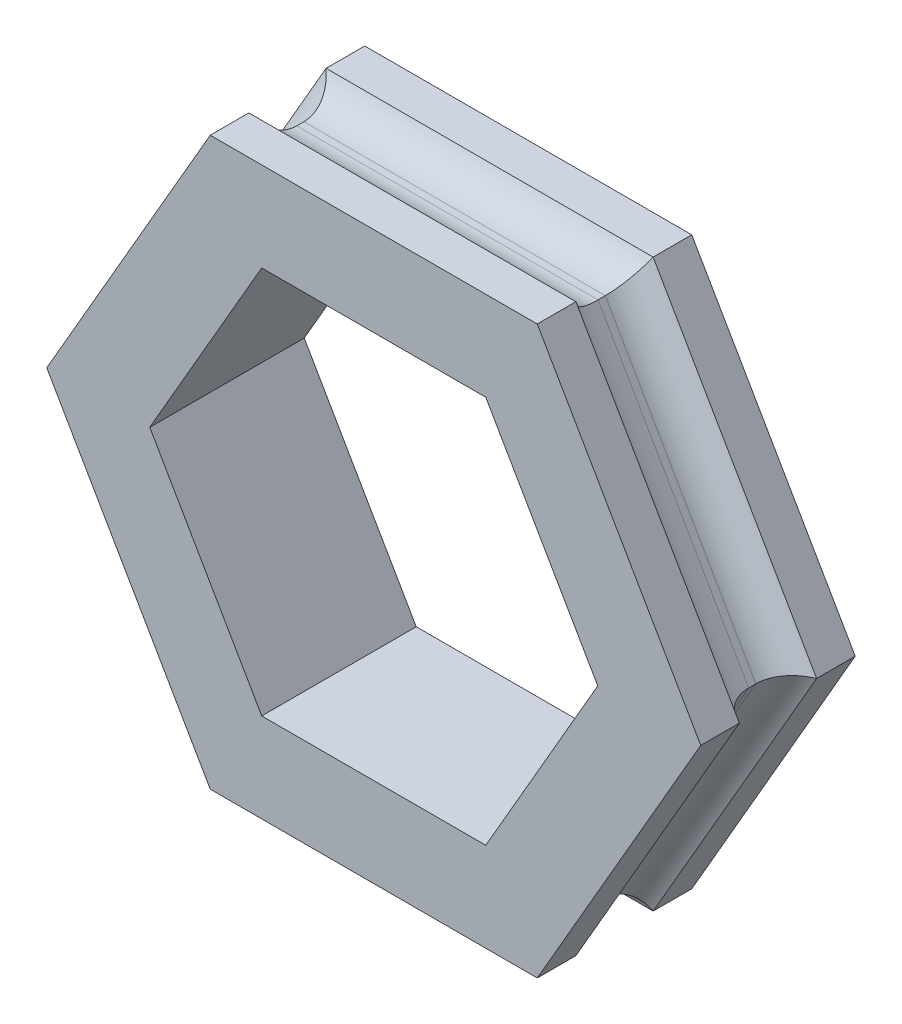
ISO-10303-21;
HEADER;
FILE_DESCRIPTION(('STEP AP214'),'2;1');
FILE_NAME('part.step','',(''),(''),'','','');
FILE_SCHEMA(('AUTOMOTIVE_DESIGN { 1 0 10303 214 1 1 1 1 }'));
ENDSEC;
DATA;
#1=APPLICATION_CONTEXT('core data for automotive mechanical design processes');
#2=APPLICATION_PROTOCOL_DEFINITION('international standard','automotive_design',2000,#1);
#3=PRODUCT_CONTEXT('',#1,'mechanical');
#4=PRODUCT('Part','Part','',(#3));
#5=PRODUCT_RELATED_PRODUCT_CATEGORY('part','',(#4));
#6=PRODUCT_DEFINITION_FORMATION('','',#4);
#7=PRODUCT_DEFINITION_CONTEXT('part definition',#1,'design');
#8=PRODUCT_DEFINITION('design','',#6,#7);
#9=PRODUCT_DEFINITION_SHAPE('','',#8);
#10=(LENGTH_UNIT() NAMED_UNIT(*) SI_UNIT(.MILLI.,.METRE.));
#11=(NAMED_UNIT(*) PLANE_ANGLE_UNIT() SI_UNIT($,.RADIAN.));
#12=(NAMED_UNIT(*) SI_UNIT($,.STERADIAN.) SOLID_ANGLE_UNIT());
#13=UNCERTAINTY_MEASURE_WITH_UNIT(LENGTH_MEASURE(1.E-05),#10,'distance_accuracy_value','');
#14=(GEOMETRIC_REPRESENTATION_CONTEXT(3) GLOBAL_UNCERTAINTY_ASSIGNED_CONTEXT((#13)) GLOBAL_UNIT_ASSIGNED_CONTEXT((#10,
#11,#12)) REPRESENTATION_CONTEXT('',''));
#15=CARTESIAN_POINT('',(0.,0.,0.));
#16=DIRECTION('',(0.,0.,1.));
#17=DIRECTION('',(1.,0.,0.));
#18=AXIS2_PLACEMENT_3D('',#15,#16,#17);
#19=CARTESIAN_POINT('',(0.,-5.49926131403118,-1.5));
#20=DIRECTION('',(0.,-1.,0.));
#21=DIRECTION('',(1.,0.,0.));
#22=AXIS2_PLACEMENT_3D('',#19,#20,#21);
#23=PLANE('',#22);
#24=DIRECTION('',(0.,0.,1.));
#25=VECTOR('',#24,1.);
#26=CARTESIAN_POINT('',(3.175,-5.49926131403119,-1.5));
#27=LINE('',#26,#25);
#28=CARTESIAN_POINT('',(3.175,-5.49926131403119,-1.5));
#29=VERTEX_POINT('',#28);
#30=CARTESIAN_POINT('',(3.175,-5.49926131403119,-0.75));
#31=VERTEX_POINT('',#30);
#32=EDGE_CURVE('E370',#29,#31,#27,.T.);
#33=ORIENTED_EDGE('',*,*,#32,.T.);
#34=DIRECTION('',(1.,0.,0.));
#35=VECTOR('',#34,1.);
#36=CARTESIAN_POINT('',(0.,-5.49926131403118,-0.75));
#37=LINE('',#36,#35);
#38=CARTESIAN_POINT('',(-3.175,-5.49926131403118,-0.75));
#39=VERTEX_POINT('',#38);
#40=EDGE_CURVE('E237',#39,#31,#37,.T.);
#41=ORIENTED_EDGE('',*,*,#40,.F.);
#42=DIRECTION('',(0.,0.,1.));
#43=VECTOR('',#42,1.);
#44=CARTESIAN_POINT('',(-3.175,-5.49926131403118,-1.5));
#45=LINE('',#44,#43);
#46=CARTESIAN_POINT('',(-3.175,-5.49926131403118,-1.5));
#47=VERTEX_POINT('',#46);
#48=EDGE_CURVE('E357',#47,#39,#45,.T.);
#49=ORIENTED_EDGE('',*,*,#48,.F.);
#50=DIRECTION('',(1.,0.,0.));
#51=VECTOR('',#50,1.);
#52=CARTESIAN_POINT('',(0.,-5.49926131403118,-1.5));
#53=LINE('',#52,#51);
#54=EDGE_CURVE('E315',#47,#29,#53,.T.);
#55=ORIENTED_EDGE('',*,*,#54,.T.);
#56=EDGE_LOOP('',(#33,#41,#49,#55));
#57=FACE_BOUND('',#56,.T.);
#58=ADVANCED_FACE('F35',(#57),#23,.T.);
#59=CARTESIAN_POINT('',(-4.7625,-2.74963065701559,-1.5));
#60=DIRECTION('',(-0.866025403784438,-0.5,0.));
#61=DIRECTION('',(0.5,-0.866025403784439,0.));
#62=AXIS2_PLACEMENT_3D('',#59,#60,#61);
#63=PLANE('',#62);
#64=ORIENTED_EDGE('',*,*,#48,.T.);
#65=DIRECTION('',(0.5,-0.866025403784439,0.));
#66=VECTOR('',#65,1.);
#67=CARTESIAN_POINT('',(-4.7625,-2.74963065701559,-0.75));
#68=LINE('',#67,#66);
#69=CARTESIAN_POINT('',(-6.35,0.,-0.75));
#70=VERTEX_POINT('',#69);
#71=EDGE_CURVE('E247',#70,#39,#68,.T.);
#72=ORIENTED_EDGE('',*,*,#71,.F.);
#73=DIRECTION('',(0.,0.,1.));
#74=VECTOR('',#73,1.);
#75=CARTESIAN_POINT('',(-6.35,0.,-1.5));
#76=LINE('',#75,#74);
#77=CARTESIAN_POINT('',(-6.35,0.,-1.5));
#78=VERTEX_POINT('',#77);
#79=EDGE_CURVE('E361',#78,#70,#76,.T.);
#80=ORIENTED_EDGE('',*,*,#79,.F.);
#81=DIRECTION('',(0.5,-0.866025403784439,0.));
#82=VECTOR('',#81,1.);
#83=CARTESIAN_POINT('',(-4.7625,-2.74963065701559,-1.5));
#84=LINE('',#83,#82);
#85=EDGE_CURVE('E327',#78,#47,#84,.T.);
#86=ORIENTED_EDGE('',*,*,#85,.T.);
#87=EDGE_LOOP('',(#64,#72,#80,#86));
#88=FACE_BOUND('',#87,.T.);
#89=ADVANCED_FACE('F433',(#88),#63,.T.);
#90=CARTESIAN_POINT('',(-4.7625,2.74963065701559,-1.5));
#91=DIRECTION('',(-0.866025403784439,0.5,0.));
#92=DIRECTION('',(-0.5,-0.866025403784439,0.));
#93=AXIS2_PLACEMENT_3D('',#90,#91,#92);
#94=PLANE('',#93);
#95=ORIENTED_EDGE('',*,*,#79,.T.);
#96=DIRECTION('',(-0.5,-0.866025403784439,0.));
#97=VECTOR('',#96,1.);
#98=CARTESIAN_POINT('',(-4.7625,2.74963065701559,-0.75));
#99=LINE('',#98,#97);
#100=CARTESIAN_POINT('',(-3.175,5.49926131403119,-0.75));
#101=VERTEX_POINT('',#100);
#102=EDGE_CURVE('E244',#101,#70,#99,.T.);
#103=ORIENTED_EDGE('',*,*,#102,.F.);
#104=DIRECTION('',(0.,0.,1.));
#105=VECTOR('',#104,1.);
#106=CARTESIAN_POINT('',(-3.175,5.49926131403119,-1.5));
#107=LINE('',#106,#105);
#108=CARTESIAN_POINT('',(-3.175,5.49926131403119,-1.5));
#109=VERTEX_POINT('',#108);
#110=EDGE_CURVE('E365',#109,#101,#107,.T.);
#111=ORIENTED_EDGE('',*,*,#110,.F.);
#112=DIRECTION('',(-0.5,-0.866025403784439,0.));
#113=VECTOR('',#112,1.);
#114=CARTESIAN_POINT('',(-4.7625,2.74963065701559,-1.5));
#115=LINE('',#114,#113);
#116=EDGE_CURVE('E324',#109,#78,#115,.T.);
#117=ORIENTED_EDGE('',*,*,#116,.T.);
#118=EDGE_LOOP('',(#95,#103,#111,#117));
#119=FACE_BOUND('',#118,.T.);
#120=ADVANCED_FACE('F426',(#119),#94,.T.);
#121=CARTESIAN_POINT('',(0.,5.49926131403119,-1.5));
#122=DIRECTION('',(0.,1.,0.));
#123=DIRECTION('',(0.,0.,1.));
#124=AXIS2_PLACEMENT_3D('',#121,#122,#123);
#125=PLANE('',#124);
#126=ORIENTED_EDGE('',*,*,#110,.T.);
#127=DIRECTION('',(-1.,0.,0.));
#128=VECTOR('',#127,1.);
#129=CARTESIAN_POINT('',(0.,5.49926131403119,-0.75));
#130=LINE('',#129,#128);
#131=CARTESIAN_POINT('',(3.175,5.49926131403119,-0.75));
#132=VERTEX_POINT('',#131);
#133=EDGE_CURVE('E212',#132,#101,#130,.T.);
#134=ORIENTED_EDGE('',*,*,#133,.F.);
#135=DIRECTION('',(0.,0.,1.));
#136=VECTOR('',#135,1.);
#137=CARTESIAN_POINT('',(3.175,5.49926131403119,-1.5));
#138=LINE('',#137,#136);
#139=CARTESIAN_POINT('',(3.175,5.49926131403119,-1.5));
#140=VERTEX_POINT('',#139);
#141=EDGE_CURVE('E207',#140,#132,#138,.T.);
#142=ORIENTED_EDGE('',*,*,#141,.F.);
#143=DIRECTION('',(-1.,0.,0.));
#144=VECTOR('',#143,1.);
#145=CARTESIAN_POINT('',(0.,5.49926131403119,-1.5));
#146=LINE('',#145,#144);
#147=EDGE_CURVE('E321',#140,#109,#146,.T.);
#148=ORIENTED_EDGE('',*,*,#147,.T.);
#149=EDGE_LOOP('',(#126,#134,#142,#148));
#150=FACE_BOUND('',#149,.T.);
#151=ADVANCED_FACE('F422',(#150),#125,.T.);
#152=CARTESIAN_POINT('',(4.7625,2.74963065701559,-1.5));
#153=DIRECTION('',(0.866025403784438,0.5,0.));
#154=DIRECTION('',(-0.5,0.866025403784439,0.));
#155=AXIS2_PLACEMENT_3D('',#152,#153,#154);
#156=PLANE('',#155);
#157=ORIENTED_EDGE('',*,*,#141,.T.);
#158=DIRECTION('',(-0.5,0.866025403784439,0.));
#159=VECTOR('',#158,1.);
#160=CARTESIAN_POINT('',(4.7625,2.74963065701559,-0.75));
#161=LINE('',#160,#159);
#162=CARTESIAN_POINT('',(6.35,0.,-0.75));
#163=VERTEX_POINT('',#162);
#164=EDGE_CURVE('E201',#163,#132,#161,.T.);
#165=ORIENTED_EDGE('',*,*,#164,.F.);
#166=DIRECTION('',(0.,0.,1.));
#167=VECTOR('',#166,1.);
#168=CARTESIAN_POINT('',(6.35,0.,-1.5));
#169=LINE('',#168,#167);
#170=CARTESIAN_POINT('',(6.35,0.,-1.5));
#171=VERTEX_POINT('',#170);
#172=EDGE_CURVE('E205',#171,#163,#169,.T.);
#173=ORIENTED_EDGE('',*,*,#172,.F.);
#174=DIRECTION('',(-0.5,0.866025403784439,0.));
#175=VECTOR('',#174,1.);
#176=CARTESIAN_POINT('',(4.7625,2.74963065701559,-1.5));
#177=LINE('',#176,#175);
#178=EDGE_CURVE('E319',#171,#140,#177,.T.);
#179=ORIENTED_EDGE('',*,*,#178,.T.);
#180=EDGE_LOOP('',(#157,#165,#173,#179));
#181=FACE_BOUND('',#180,.T.);
#182=ADVANCED_FACE('F203',(#181),#156,.T.);
#183=CARTESIAN_POINT('',(4.7625,-2.74963065701559,-1.5));
#184=DIRECTION('',(0.866025403784439,-0.5,0.));
#185=DIRECTION('',(0.5,0.866025403784439,0.));
#186=AXIS2_PLACEMENT_3D('',#183,#184,#185);
#187=PLANE('',#186);
#188=ORIENTED_EDGE('',*,*,#172,.T.);
#189=DIRECTION('',(0.5,0.866025403784439,0.));
#190=VECTOR('',#189,1.);
#191=CARTESIAN_POINT('',(4.7625,-2.74963065701559,-0.75));
#192=LINE('',#191,#190);
#193=EDGE_CURVE('E213',#31,#163,#192,.T.);
#194=ORIENTED_EDGE('',*,*,#193,.F.);
#195=ORIENTED_EDGE('',*,*,#32,.F.);
#196=DIRECTION('',(0.5,0.866025403784439,0.));
#197=VECTOR('',#196,1.);
#198=CARTESIAN_POINT('',(4.7625,-2.74963065701559,-1.5));
#199=LINE('',#198,#197);
#200=EDGE_CURVE('E221',#29,#171,#199,.T.);
#201=ORIENTED_EDGE('',*,*,#200,.T.);
#202=EDGE_LOOP('',(#188,#194,#195,#201));
#203=FACE_BOUND('',#202,.T.);
#204=ADVANCED_FACE('F217',(#203),#187,.T.);
#205=CARTESIAN_POINT('',(3.2625,-1.88360525323115,-1.5));
#206=DIRECTION('',(0.866025403784439,-0.5,0.));
#207=DIRECTION('',(0.5,0.866025403784439,0.));
#208=AXIS2_PLACEMENT_3D('',#205,#206,#207);
#209=PLANE('',#208);
#210=DIRECTION('',(0.,0.,1.));
#211=VECTOR('',#210,1.);
#212=CARTESIAN_POINT('',(2.175,-3.76721050646231,-1.5));
#213=LINE('',#212,#211);
#214=CARTESIAN_POINT('',(2.175,-3.76721050646231,-1.5));
#215=VERTEX_POINT('',#214);
#216=CARTESIAN_POINT('',(2.175,-3.76721050646231,1.5));
#217=VERTEX_POINT('',#216);
#218=EDGE_CURVE('E355',#215,#217,#213,.T.);
#219=ORIENTED_EDGE('',*,*,#218,.T.);
#220=DIRECTION('',(0.5,0.866025403784439,0.));
#221=VECTOR('',#220,1.);
#222=CARTESIAN_POINT('',(3.2625,-1.88360525323115,1.5));
#223=LINE('',#222,#221);
#224=CARTESIAN_POINT('',(4.35,0.,1.5));
#225=VERTEX_POINT('',#224);
#226=EDGE_CURVE('E297',#217,#225,#223,.T.);
#227=ORIENTED_EDGE('',*,*,#226,.T.);
#228=DIRECTION('',(0.,0.,1.));
#229=VECTOR('',#228,1.);
#230=CARTESIAN_POINT('',(4.35,0.,-1.5));
#231=LINE('',#230,#229);
#232=CARTESIAN_POINT('',(4.35,0.,-1.5));
#233=VERTEX_POINT('',#232);
#234=EDGE_CURVE('E344',#233,#225,#231,.T.);
#235=ORIENTED_EDGE('',*,*,#234,.F.);
#236=DIRECTION('',(0.5,0.866025403784439,0.));
#237=VECTOR('',#236,1.);
#238=CARTESIAN_POINT('',(3.2625,-1.88360525323115,-1.5));
#239=LINE('',#238,#237);
#240=EDGE_CURVE('E330',#215,#233,#239,.T.);
#241=ORIENTED_EDGE('',*,*,#240,.F.);
#242=EDGE_LOOP('',(#219,#227,#235,#241));
#243=FACE_BOUND('',#242,.T.);
#244=ADVANCED_FACE('F557',(#243),#209,.F.);
#245=CARTESIAN_POINT('',(3.2625,1.88360525323115,-1.5));
#246=DIRECTION('',(0.866025403784439,0.5,0.));
#247=DIRECTION('',(-0.5,0.866025403784439,0.));
#248=AXIS2_PLACEMENT_3D('',#245,#246,#247);
#249=PLANE('',#248);
#250=ORIENTED_EDGE('',*,*,#234,.T.);
#251=DIRECTION('',(-0.5,0.866025403784439,0.));
#252=VECTOR('',#251,1.);
#253=CARTESIAN_POINT('',(3.2625,1.88360525323115,1.5));
#254=LINE('',#253,#252);
#255=CARTESIAN_POINT('',(2.175,3.76721050646231,1.5));
#256=VERTEX_POINT('',#255);
#257=EDGE_CURVE('E312',#225,#256,#254,.T.);
#258=ORIENTED_EDGE('',*,*,#257,.T.);
#259=DIRECTION('',(0.,0.,1.));
#260=VECTOR('',#259,1.);
#261=CARTESIAN_POINT('',(2.175,3.76721050646231,-1.5));
#262=LINE('',#261,#260);
#263=CARTESIAN_POINT('',(2.175,3.76721050646231,-1.5));
#264=VERTEX_POINT('',#263);
#265=EDGE_CURVE('E347',#264,#256,#262,.T.);
#266=ORIENTED_EDGE('',*,*,#265,.F.);
#267=DIRECTION('',(-0.5,0.866025403784439,0.));
#268=VECTOR('',#267,1.);
#269=CARTESIAN_POINT('',(3.2625,1.88360525323115,-1.5));
#270=LINE('',#269,#268);
#271=EDGE_CURVE('E341',#233,#264,#270,.T.);
#272=ORIENTED_EDGE('',*,*,#271,.F.);
#273=EDGE_LOOP('',(#250,#258,#266,#272));
#274=FACE_BOUND('',#273,.T.);
#275=ADVANCED_FACE('F561',(#274),#249,.F.);
#276=CARTESIAN_POINT('',(0.,3.76721050646231,-1.5));
#277=DIRECTION('',(0.,1.,0.));
#278=DIRECTION('',(0.,0.,1.));
#279=AXIS2_PLACEMENT_3D('',#276,#277,#278);
#280=PLANE('',#279);
#281=ORIENTED_EDGE('',*,*,#265,.T.);
#282=DIRECTION('',(-1.,0.,0.));
#283=VECTOR('',#282,1.);
#284=CARTESIAN_POINT('',(0.,3.76721050646231,1.5));
#285=LINE('',#284,#283);
#286=CARTESIAN_POINT('',(-2.175,3.76721050646231,1.5));
#287=VERTEX_POINT('',#286);
#288=EDGE_CURVE('E309',#256,#287,#285,.T.);
#289=ORIENTED_EDGE('',*,*,#288,.T.);
#290=DIRECTION('',(0.,0.,1.));
#291=VECTOR('',#290,1.);
#292=CARTESIAN_POINT('',(-2.175,3.76721050646231,-1.5));
#293=LINE('',#292,#291);
#294=CARTESIAN_POINT('',(-2.175,3.76721050646231,-1.5));
#295=VERTEX_POINT('',#294);
#296=EDGE_CURVE('E349',#295,#287,#293,.T.);
#297=ORIENTED_EDGE('',*,*,#296,.F.);
#298=DIRECTION('',(-1.,0.,0.));
#299=VECTOR('',#298,1.);
#300=CARTESIAN_POINT('',(0.,3.76721050646231,-1.5));
#301=LINE('',#300,#299);
#302=EDGE_CURVE('E339',#264,#295,#301,.T.);
#303=ORIENTED_EDGE('',*,*,#302,.F.);
#304=EDGE_LOOP('',(#281,#289,#297,#303));
#305=FACE_BOUND('',#304,.T.);
#306=ADVANCED_FACE('F567',(#305),#280,.F.);
#307=CARTESIAN_POINT('',(-3.2625,1.88360525323115,-1.5));
#308=DIRECTION('',(-0.866025403784439,0.5,0.));
#309=DIRECTION('',(-0.5,-0.866025403784439,0.));
#310=AXIS2_PLACEMENT_3D('',#307,#308,#309);
#311=PLANE('',#310);
#312=ORIENTED_EDGE('',*,*,#296,.T.);
#313=DIRECTION('',(-0.5,-0.866025403784439,0.));
#314=VECTOR('',#313,1.);
#315=CARTESIAN_POINT('',(-3.2625,1.88360525323115,1.5));
#316=LINE('',#315,#314);
#317=CARTESIAN_POINT('',(-4.35,0.,1.5));
#318=VERTEX_POINT('',#317);
#319=EDGE_CURVE('E306',#287,#318,#316,.T.);
#320=ORIENTED_EDGE('',*,*,#319,.T.);
#321=DIRECTION('',(0.,0.,1.));
#322=VECTOR('',#321,1.);
#323=CARTESIAN_POINT('',(-4.35,0.,-1.5));
#324=LINE('',#323,#322);
#325=CARTESIAN_POINT('',(-4.35,0.,-1.5));
#326=VERTEX_POINT('',#325);
#327=EDGE_CURVE('E351',#326,#318,#324,.T.);
#328=ORIENTED_EDGE('',*,*,#327,.F.);
#329=DIRECTION('',(-0.5,-0.866025403784439,0.));
#330=VECTOR('',#329,1.);
#331=CARTESIAN_POINT('',(-3.2625,1.88360525323115,-1.5));
#332=LINE('',#331,#330);
#333=EDGE_CURVE('E337',#295,#326,#332,.T.);
#334=ORIENTED_EDGE('',*,*,#333,.F.);
#335=EDGE_LOOP('',(#312,#320,#328,#334));
#336=FACE_BOUND('',#335,.T.);
#337=ADVANCED_FACE('F475',(#336),#311,.F.);
#338=CARTESIAN_POINT('',(-3.2625,-1.88360525323115,-1.5));
#339=DIRECTION('',(-0.866025403784438,-0.5,0.));
#340=DIRECTION('',(0.5,-0.866025403784439,0.));
#341=AXIS2_PLACEMENT_3D('',#338,#339,#340);
#342=PLANE('',#341);
#343=ORIENTED_EDGE('',*,*,#327,.T.);
#344=DIRECTION('',(0.5,-0.866025403784439,0.));
#345=VECTOR('',#344,1.);
#346=CARTESIAN_POINT('',(-3.2625,-1.88360525323115,1.5));
#347=LINE('',#346,#345);
#348=CARTESIAN_POINT('',(-2.175,-3.76721050646231,1.5));
#349=VERTEX_POINT('',#348);
#350=EDGE_CURVE('E303',#318,#349,#347,.T.);
#351=ORIENTED_EDGE('',*,*,#350,.T.);
#352=DIRECTION('',(0.,0.,1.));
#353=VECTOR('',#352,1.);
#354=CARTESIAN_POINT('',(-2.175,-3.76721050646231,-1.5));
#355=LINE('',#354,#353);
#356=CARTESIAN_POINT('',(-2.175,-3.76721050646231,-1.5));
#357=VERTEX_POINT('',#356);
#358=EDGE_CURVE('E353',#357,#349,#355,.T.);
#359=ORIENTED_EDGE('',*,*,#358,.F.);
#360=DIRECTION('',(0.5,-0.866025403784439,0.));
#361=VECTOR('',#360,1.);
#362=CARTESIAN_POINT('',(-3.2625,-1.88360525323115,-1.5));
#363=LINE('',#362,#361);
#364=EDGE_CURVE('E335',#326,#357,#363,.T.);
#365=ORIENTED_EDGE('',*,*,#364,.F.);
#366=EDGE_LOOP('',(#343,#351,#359,#365));
#367=FACE_BOUND('',#366,.T.);
#368=ADVANCED_FACE('F467',(#367),#342,.F.);
#369=DIRECTION('',(1.,0.,0.));
#370=VECTOR('',#369,1.);
#371=CARTESIAN_POINT('',(0.,-5.49926131403118,0.75));
#372=LINE('',#371,#370);
#373=CARTESIAN_POINT('',(-3.175,-5.49926131403118,0.75));
#374=VERTEX_POINT('',#373);
#375=CARTESIAN_POINT('',(3.175,-5.49926131403119,0.75));
#376=VERTEX_POINT('',#375);
#377=EDGE_CURVE('E249',#374,#376,#372,.T.);
#378=ORIENTED_EDGE('',*,*,#377,.T.);
#379=CARTESIAN_POINT('',(3.175,-5.49926131403119,1.5));
#380=VERTEX_POINT('',#379);
#381=EDGE_CURVE('E343',#376,#380,#27,.T.);
#382=ORIENTED_EDGE('',*,*,#381,.T.);
#383=DIRECTION('',(1.,0.,0.));
#384=VECTOR('',#383,1.);
#385=CARTESIAN_POINT('',(0.,-5.49926131403118,1.5));
#386=LINE('',#385,#384);
#387=CARTESIAN_POINT('',(-3.175,-5.49926131403118,1.5));
#388=VERTEX_POINT('',#387);
#389=EDGE_CURVE('E279',#388,#380,#386,.T.);
#390=ORIENTED_EDGE('',*,*,#389,.F.);
#391=EDGE_CURVE('E360',#374,#388,#45,.T.);
#392=ORIENTED_EDGE('',*,*,#391,.F.);
#393=EDGE_LOOP('',(#378,#382,#390,#392));
#394=FACE_BOUND('',#393,.T.);
#395=ADVANCED_FACE('F458',(#394),#23,.T.);
#396=DIRECTION('',(0.5,-0.866025403784439,0.));
#397=VECTOR('',#396,1.);
#398=CARTESIAN_POINT('',(-4.7625,-2.74963065701559,0.75));
#399=LINE('',#398,#397);
#400=CARTESIAN_POINT('',(-6.35,0.,0.75));
#401=VERTEX_POINT('',#400);
#402=EDGE_CURVE('E260',#401,#374,#399,.T.);
#403=ORIENTED_EDGE('',*,*,#402,.T.);
#404=ORIENTED_EDGE('',*,*,#391,.T.);
#405=DIRECTION('',(0.5,-0.866025403784439,0.));
#406=VECTOR('',#405,1.);
#407=CARTESIAN_POINT('',(-4.7625,-2.74963065701559,1.5));
#408=LINE('',#407,#406);
#409=CARTESIAN_POINT('',(-6.35,0.,1.5));
#410=VERTEX_POINT('',#409);
#411=EDGE_CURVE('E294',#410,#388,#408,.T.);
#412=ORIENTED_EDGE('',*,*,#411,.F.);
#413=EDGE_CURVE('E364',#401,#410,#76,.T.);
#414=ORIENTED_EDGE('',*,*,#413,.F.);
#415=EDGE_LOOP('',(#403,#404,#412,#414));
#416=FACE_BOUND('',#415,.T.);
#417=ADVANCED_FACE('F463',(#416),#63,.T.);
#418=DIRECTION('',(-0.5,-0.866025403784439,0.));
#419=VECTOR('',#418,1.);
#420=CARTESIAN_POINT('',(-4.7625,2.74963065701559,0.75));
#421=LINE('',#420,#419);
#422=CARTESIAN_POINT('',(-3.175,5.49926131403119,0.75));
#423=VERTEX_POINT('',#422);
#424=EDGE_CURVE('E257',#423,#401,#421,.T.);
#425=ORIENTED_EDGE('',*,*,#424,.T.);
#426=ORIENTED_EDGE('',*,*,#413,.T.);
#427=DIRECTION('',(-0.5,-0.866025403784439,0.));
#428=VECTOR('',#427,1.);
#429=CARTESIAN_POINT('',(-4.7625,2.74963065701559,1.5));
#430=LINE('',#429,#428);
#431=CARTESIAN_POINT('',(-3.175,5.49926131403119,1.5));
#432=VERTEX_POINT('',#431);
#433=EDGE_CURVE('E291',#432,#410,#430,.T.);
#434=ORIENTED_EDGE('',*,*,#433,.F.);
#435=EDGE_CURVE('E368',#423,#432,#107,.T.);
#436=ORIENTED_EDGE('',*,*,#435,.F.);
#437=EDGE_LOOP('',(#425,#426,#434,#436));
#438=FACE_BOUND('',#437,.T.);
#439=ADVANCED_FACE('F473',(#438),#94,.T.);
#440=DIRECTION('',(-1.,0.,0.));
#441=VECTOR('',#440,1.);
#442=CARTESIAN_POINT('',(0.,5.49926131403119,0.75));
#443=LINE('',#442,#441);
#444=CARTESIAN_POINT('',(3.175,5.49926131403119,0.75));
#445=VERTEX_POINT('',#444);
#446=EDGE_CURVE('E255',#445,#423,#443,.T.);
#447=ORIENTED_EDGE('',*,*,#446,.T.);
#448=ORIENTED_EDGE('',*,*,#435,.T.);
#449=DIRECTION('',(-1.,0.,0.));
#450=VECTOR('',#449,1.);
#451=CARTESIAN_POINT('',(0.,5.49926131403119,1.5));
#452=LINE('',#451,#450);
#453=CARTESIAN_POINT('',(3.175,5.49926131403119,1.5));
#454=VERTEX_POINT('',#453);
#455=EDGE_CURVE('E288',#454,#432,#452,.T.);
#456=ORIENTED_EDGE('',*,*,#455,.F.);
#457=EDGE_CURVE('E222',#445,#454,#138,.T.);
#458=ORIENTED_EDGE('',*,*,#457,.F.);
#459=EDGE_LOOP('',(#447,#448,#456,#458));
#460=FACE_BOUND('',#459,.T.);
#461=ADVANCED_FACE('F526',(#460),#125,.T.);
#462=DIRECTION('',(-0.5,0.866025403784439,0.));
#463=VECTOR('',#462,1.);
#464=CARTESIAN_POINT('',(4.7625,2.74963065701559,0.75));
#465=LINE('',#464,#463);
#466=CARTESIAN_POINT('',(6.35,0.,0.75));
#467=VERTEX_POINT('',#466);
#468=EDGE_CURVE('E253',#467,#445,#465,.T.);
#469=ORIENTED_EDGE('',*,*,#468,.T.);
#470=ORIENTED_EDGE('',*,*,#457,.T.);
#471=DIRECTION('',(-0.5,0.866025403784439,0.));
#472=VECTOR('',#471,1.);
#473=CARTESIAN_POINT('',(4.7625,2.74963065701559,1.5));
#474=LINE('',#473,#472);
#475=CARTESIAN_POINT('',(6.35,0.,1.5));
#476=VERTEX_POINT('',#475);
#477=EDGE_CURVE('E285',#476,#454,#474,.T.);
#478=ORIENTED_EDGE('',*,*,#477,.F.);
#479=EDGE_CURVE('E223',#467,#476,#169,.T.);
#480=ORIENTED_EDGE('',*,*,#479,.F.);
#481=EDGE_LOOP('',(#469,#470,#478,#480));
#482=FACE_BOUND('',#481,.T.);
#483=ADVANCED_FACE('F522',(#482),#156,.T.);
#484=DIRECTION('',(0.5,0.866025403784439,0.));
#485=VECTOR('',#484,1.);
#486=CARTESIAN_POINT('',(4.7625,-2.74963065701559,0.75));
#487=LINE('',#486,#485);
#488=EDGE_CURVE('E251',#376,#467,#487,.T.);
#489=ORIENTED_EDGE('',*,*,#488,.T.);
#490=ORIENTED_EDGE('',*,*,#479,.T.);
#491=DIRECTION('',(0.5,0.866025403784439,0.));
#492=VECTOR('',#491,1.);
#493=CARTESIAN_POINT('',(4.7625,-2.74963065701559,1.5));
#494=LINE('',#493,#492);
#495=EDGE_CURVE('E282',#380,#476,#494,.T.);
#496=ORIENTED_EDGE('',*,*,#495,.F.);
#497=ORIENTED_EDGE('',*,*,#381,.F.);
#498=EDGE_LOOP('',(#489,#490,#496,#497));
#499=FACE_BOUND('',#498,.T.);
#500=ADVANCED_FACE('F486',(#499),#187,.T.);
#501=CARTESIAN_POINT('',(0.,-3.76721050646231,-1.5));
#502=DIRECTION('',(0.,-1.,0.));
#503=DIRECTION('',(1.,0.,0.));
#504=AXIS2_PLACEMENT_3D('',#501,#502,#503);
#505=PLANE('',#504);
#506=ORIENTED_EDGE('',*,*,#358,.T.);
#507=DIRECTION('',(1.,0.,0.));
#508=VECTOR('',#507,1.);
#509=CARTESIAN_POINT('',(0.,-3.76721050646231,1.5));
#510=LINE('',#509,#508);
#511=EDGE_CURVE('E300',#349,#217,#510,.T.);
#512=ORIENTED_EDGE('',*,*,#511,.T.);
#513=ORIENTED_EDGE('',*,*,#218,.F.);
#514=DIRECTION('',(1.,0.,0.));
#515=VECTOR('',#514,1.);
#516=CARTESIAN_POINT('',(0.,-3.76721050646231,-1.5));
#517=LINE('',#516,#515);
#518=EDGE_CURVE('E333',#357,#215,#517,.T.);
#519=ORIENTED_EDGE('',*,*,#518,.F.);
#520=EDGE_LOOP('',(#506,#512,#513,#519));
#521=FACE_BOUND('',#520,.T.);
#522=ADVANCED_FACE('F550',(#521),#505,.F.);
#523=CARTESIAN_POINT('',(0.,0.,-1.5));
#524=DIRECTION('',(0.,0.,1.));
#525=DIRECTION('',(1.,0.,0.));
#526=AXIS2_PLACEMENT_3D('',#523,#524,#525);
#527=PLANE('',#526);
#528=ORIENTED_EDGE('',*,*,#54,.F.);
#529=ORIENTED_EDGE('',*,*,#85,.F.);
#530=ORIENTED_EDGE('',*,*,#116,.F.);
#531=ORIENTED_EDGE('',*,*,#147,.F.);
#532=ORIENTED_EDGE('',*,*,#178,.F.);
#533=ORIENTED_EDGE('',*,*,#200,.F.);
#534=EDGE_LOOP('',(#528,#529,#530,#531,#532,#533));
#535=FACE_BOUND('',#534,.T.);
#536=ORIENTED_EDGE('',*,*,#240,.T.);
#537=ORIENTED_EDGE('',*,*,#271,.T.);
#538=ORIENTED_EDGE('',*,*,#302,.T.);
#539=ORIENTED_EDGE('',*,*,#333,.T.);
#540=ORIENTED_EDGE('',*,*,#364,.T.);
#541=ORIENTED_EDGE('',*,*,#518,.T.);
#542=EDGE_LOOP('',(#536,#537,#538,#539,#540,#541));
#543=FACE_BOUND('',#542,.T.);
#544=ADVANCED_FACE('F430',(#535,#543),#527,.F.);
#545=CARTESIAN_POINT('',(0.,0.,1.5));
#546=DIRECTION('',(0.,0.,1.));
#547=DIRECTION('',(1.,0.,0.));
#548=AXIS2_PLACEMENT_3D('',#545,#546,#547);
#549=PLANE('',#548);
#550=ORIENTED_EDGE('',*,*,#389,.T.);
#551=ORIENTED_EDGE('',*,*,#495,.T.);
#552=ORIENTED_EDGE('',*,*,#477,.T.);
#553=ORIENTED_EDGE('',*,*,#455,.T.);
#554=ORIENTED_EDGE('',*,*,#433,.T.);
#555=ORIENTED_EDGE('',*,*,#411,.T.);
#556=EDGE_LOOP('',(#550,#551,#552,#553,#554,#555));
#557=FACE_BOUND('',#556,.T.);
#558=ORIENTED_EDGE('',*,*,#226,.F.);
#559=ORIENTED_EDGE('',*,*,#511,.F.);
#560=ORIENTED_EDGE('',*,*,#350,.F.);
#561=ORIENTED_EDGE('',*,*,#319,.F.);
#562=ORIENTED_EDGE('',*,*,#288,.F.);
#563=ORIENTED_EDGE('',*,*,#257,.F.);
#564=EDGE_LOOP('',(#558,#559,#560,#561,#562,#563));
#565=FACE_BOUND('',#564,.T.);
#566=ADVANCED_FACE('F452',(#557,#565),#549,.T.);
#567=CARTESIAN_POINT('',(4.3875,-2.53312430606948,0.75));
#568=DIRECTION('',(-0.866025403784439,0.5,0.));
#569=DIRECTION('',(-0.5,-0.866025403784439,0.));
#570=AXIS2_PLACEMENT_3D('',#567,#568,#569);
#571=PLANE('',#570);
#572=DIRECTION('',(0.,0.,-1.));
#573=VECTOR('',#572,1.);
#574=CARTESIAN_POINT('',(5.85,0.,0.75));
#575=LINE('',#574,#573);
#576=CARTESIAN_POINT('',(5.85,0.,0.07028016592251));
#577=VERTEX_POINT('',#576);
#578=CARTESIAN_POINT('',(5.85,0.,-0.07028016592251));
#579=VERTEX_POINT('',#578);
#580=EDGE_CURVE('E262',#577,#579,#575,.T.);
#581=ORIENTED_EDGE('',*,*,#580,.F.);
#582=DIRECTION('',(0.5,0.866025403784439,0.));
#583=VECTOR('',#582,1.);
#584=CARTESIAN_POINT('',(4.3875,-2.53312430606948,0.07028016592251));
#585=LINE('',#584,#583);
#586=CARTESIAN_POINT('',(2.925,-5.06624861213897,0.0702801659225117));
#587=VERTEX_POINT('',#586);
#588=EDGE_CURVE('E385',#577,#587,#585,.F.);
#589=ORIENTED_EDGE('',*,*,#588,.T.);
#590=DIRECTION('',(0.,0.,-1.));
#591=VECTOR('',#590,1.);
#592=CARTESIAN_POINT('',(2.925,-5.06624861213897,0.75));
#593=LINE('',#592,#591);
#594=CARTESIAN_POINT('',(2.925,-5.06624861213897,-0.0702801659225117));
#595=VERTEX_POINT('',#594);
#596=EDGE_CURVE('E276',#587,#595,#593,.T.);
#597=ORIENTED_EDGE('',*,*,#596,.T.);
#598=DIRECTION('',(0.5,0.866025403784439,0.));
#599=VECTOR('',#598,1.);
#600=CARTESIAN_POINT('',(4.3875,-2.53312430606948,-0.07028016592251));
#601=LINE('',#600,#599);
#602=EDGE_CURVE('E383',#595,#579,#601,.T.);
#603=ORIENTED_EDGE('',*,*,#602,.T.);
#604=EDGE_LOOP('',(#581,#589,#597,#603));
#605=FACE_BOUND('',#604,.T.);
#606=ADVANCED_FACE('F444',(#605),#571,.F.);
#607=CARTESIAN_POINT('',(0.,-5.06624861213897,0.75));
#608=DIRECTION('',(0.,1.,0.));
#609=DIRECTION('',(-1.,0.,0.));
#610=AXIS2_PLACEMENT_3D('',#607,#608,#609);
#611=PLANE('',#610);
#612=ORIENTED_EDGE('',*,*,#596,.F.);
#613=DIRECTION('',(1.,0.,0.));
#614=VECTOR('',#613,1.);
#615=CARTESIAN_POINT('',(0.,-5.06624861213897,0.0702801659225117));
#616=LINE('',#615,#614);
#617=CARTESIAN_POINT('',(-2.925,-5.06624861213897,0.0702801659225103));
#618=VERTEX_POINT('',#617);
#619=EDGE_CURVE('E60',#587,#618,#616,.F.);
#620=ORIENTED_EDGE('',*,*,#619,.T.);
#621=DIRECTION('',(0.,0.,-1.));
#622=VECTOR('',#621,1.);
#623=CARTESIAN_POINT('',(-2.925,-5.06624861213897,0.75));
#624=LINE('',#623,#622);
#625=CARTESIAN_POINT('',(-2.925,-5.06624861213897,-0.0702801659225117));
#626=VERTEX_POINT('',#625);
#627=EDGE_CURVE('E274',#618,#626,#624,.T.);
#628=ORIENTED_EDGE('',*,*,#627,.T.);
#629=DIRECTION('',(1.,0.,0.));
#630=VECTOR('',#629,1.);
#631=CARTESIAN_POINT('',(0.,-5.06624861213897,-0.0702801659225117));
#632=LINE('',#631,#630);
#633=EDGE_CURVE('E387',#626,#595,#632,.T.);
#634=ORIENTED_EDGE('',*,*,#633,.T.);
#635=EDGE_LOOP('',(#612,#620,#628,#634));
#636=FACE_BOUND('',#635,.T.);
#637=ADVANCED_FACE('F441',(#636),#611,.F.);
#638=CARTESIAN_POINT('',(-4.3875,-2.53312430606948,0.75));
#639=DIRECTION('',(0.866025403784439,0.5,0.));
#640=DIRECTION('',(-0.5,0.866025403784439,0.));
#641=AXIS2_PLACEMENT_3D('',#638,#639,#640);
#642=PLANE('',#641);
#643=ORIENTED_EDGE('',*,*,#627,.F.);
#644=DIRECTION('',(0.5,-0.866025403784439,0.));
#645=VECTOR('',#644,1.);
#646=CARTESIAN_POINT('',(-4.3875,-2.53312430606948,0.0702801659225103));
#647=LINE('',#646,#645);
#648=CARTESIAN_POINT('',(-5.85,0.,0.0702801659225103));
#649=VERTEX_POINT('',#648);
#650=EDGE_CURVE('E11',#618,#649,#647,.F.);
#651=ORIENTED_EDGE('',*,*,#650,.T.);
#652=DIRECTION('',(0.,0.,-1.));
#653=VECTOR('',#652,1.);
#654=CARTESIAN_POINT('',(-5.85,0.,0.75));
#655=LINE('',#654,#653);
#656=CARTESIAN_POINT('',(-5.85,0.,-0.0702801659225111));
#657=VERTEX_POINT('',#656);
#658=EDGE_CURVE('E271',#649,#657,#655,.T.);
#659=ORIENTED_EDGE('',*,*,#658,.T.);
#660=DIRECTION('',(0.5,-0.866025403784439,0.));
#661=VECTOR('',#660,1.);
#662=CARTESIAN_POINT('',(-4.3875,-2.53312430606948,-0.0702801659225103));
#663=LINE('',#662,#661);
#664=EDGE_CURVE('E44',#657,#626,#663,.T.);
#665=ORIENTED_EDGE('',*,*,#664,.T.);
#666=EDGE_LOOP('',(#643,#651,#659,#665));
#667=FACE_BOUND('',#666,.T.);
#668=ADVANCED_FACE('F438',(#667),#642,.F.);
#669=CARTESIAN_POINT('',(-4.3875,2.53312430606948,0.75));
#670=DIRECTION('',(0.866025403784439,-0.5,0.));
#671=DIRECTION('',(0.5,0.866025403784439,0.));
#672=AXIS2_PLACEMENT_3D('',#669,#670,#671);
#673=PLANE('',#672);
#674=ORIENTED_EDGE('',*,*,#658,.F.);
#675=DIRECTION('',(-0.5,-0.866025403784439,0.));
#676=VECTOR('',#675,1.);
#677=CARTESIAN_POINT('',(-4.3875,2.53312430606948,0.0702801659225111));
#678=LINE('',#677,#676);
#679=CARTESIAN_POINT('',(-2.925,5.06624861213896,0.0702801659225093));
#680=VERTEX_POINT('',#679);
#681=EDGE_CURVE('E373',#649,#680,#678,.F.);
#682=ORIENTED_EDGE('',*,*,#681,.T.);
#683=DIRECTION('',(0.,0.,-1.));
#684=VECTOR('',#683,1.);
#685=CARTESIAN_POINT('',(-2.925,5.06624861213896,0.75));
#686=LINE('',#685,#684);
#687=CARTESIAN_POINT('',(-2.925,5.06624861213896,-0.0702801659225093));
#688=VERTEX_POINT('',#687);
#689=EDGE_CURVE('E268',#680,#688,#686,.T.);
#690=ORIENTED_EDGE('',*,*,#689,.T.);
#691=DIRECTION('',(-0.5,-0.866025403784439,0.));
#692=VECTOR('',#691,1.);
#693=CARTESIAN_POINT('',(-4.3875,2.53312430606948,-0.0702801659225111));
#694=LINE('',#693,#692);
#695=EDGE_CURVE('E346',#688,#657,#694,.T.);
#696=ORIENTED_EDGE('',*,*,#695,.T.);
#697=EDGE_LOOP('',(#674,#682,#690,#696));
#698=FACE_BOUND('',#697,.T.);
#699=ADVANCED_FACE('F450',(#698),#673,.F.);
#700=CARTESIAN_POINT('',(0.,5.06624861213896,0.75));
#701=DIRECTION('',(0.,-1.,0.));
#702=DIRECTION('',(0.,0.,-1.));
#703=AXIS2_PLACEMENT_3D('',#700,#701,#702);
#704=PLANE('',#703);
#705=ORIENTED_EDGE('',*,*,#689,.F.);
#706=DIRECTION('',(-1.,0.,0.));
#707=VECTOR('',#706,1.);
#708=CARTESIAN_POINT('',(0.,5.06624861213896,0.0702801659225093));
#709=LINE('',#708,#707);
#710=CARTESIAN_POINT('',(2.925,5.06624861213896,0.0702801659225099));
#711=VERTEX_POINT('',#710);
#712=EDGE_CURVE('E378',#680,#711,#709,.F.);
#713=ORIENTED_EDGE('',*,*,#712,.T.);
#714=DIRECTION('',(0.,0.,-1.));
#715=VECTOR('',#714,1.);
#716=CARTESIAN_POINT('',(2.925,5.06624861213896,0.75));
#717=LINE('',#716,#715);
#718=CARTESIAN_POINT('',(2.925,5.06624861213896,-0.0702801659225099));
#719=VERTEX_POINT('',#718);
#720=EDGE_CURVE('E265',#711,#719,#717,.T.);
#721=ORIENTED_EDGE('',*,*,#720,.T.);
#722=DIRECTION('',(-1.,0.,0.));
#723=VECTOR('',#722,1.);
#724=CARTESIAN_POINT('',(0.,5.06624861213896,-0.0702801659225093));
#725=LINE('',#724,#723);
#726=EDGE_CURVE('E376',#719,#688,#725,.T.);
#727=ORIENTED_EDGE('',*,*,#726,.T.);
#728=EDGE_LOOP('',(#705,#713,#721,#727));
#729=FACE_BOUND('',#728,.T.);
#730=ADVANCED_FACE('F513',(#729),#704,.F.);
#731=CARTESIAN_POINT('',(4.3875,2.53312430606948,0.75));
#732=DIRECTION('',(-0.866025403784439,-0.5,0.));
#733=DIRECTION('',(0.5,-0.866025403784439,0.));
#734=AXIS2_PLACEMENT_3D('',#731,#732,#733);
#735=PLANE('',#734);
#736=ORIENTED_EDGE('',*,*,#720,.F.);
#737=DIRECTION('',(-0.5,0.866025403784439,0.));
#738=VECTOR('',#737,1.);
#739=CARTESIAN_POINT('',(4.3875,2.53312430606948,0.0702801659225099));
#740=LINE('',#739,#738);
#741=EDGE_CURVE('E381',#711,#577,#740,.F.);
#742=ORIENTED_EDGE('',*,*,#741,.T.);
#743=ORIENTED_EDGE('',*,*,#580,.T.);
#744=DIRECTION('',(-0.5,0.866025403784439,0.));
#745=VECTOR('',#744,1.);
#746=CARTESIAN_POINT('',(4.3875,2.53312430606948,-0.0702801659225099));
#747=LINE('',#746,#745);
#748=EDGE_CURVE('E228',#579,#719,#747,.T.);
#749=ORIENTED_EDGE('',*,*,#748,.T.);
#750=EDGE_LOOP('',(#736,#742,#743,#749));
#751=FACE_BOUND('',#750,.T.);
#752=ADVANCED_FACE('F516',(#751),#735,.F.);
#753=CARTESIAN_POINT('',(5.03701905283833,-2.90812430606948,0.07028016592251));
#754=DIRECTION('',(0.5,0.866025403784439,0.));
#755=DIRECTION('',(-0.866025403784439,0.5,0.));
#756=AXIS2_PLACEMENT_3D('',#753,#754,#755);
#757=CYLINDRICAL_SURFACE('',#756,0.75);
#758=CARTESIAN_POINT('',(3.35801270189222,-5.81624861213897,0.0702801659225109));
#759=DIRECTION('',(0.866025403784438,0.5,0.));
#760=DIRECTION('',(-0.5,0.866025403784439,0.));
#761=AXIS2_PLACEMENT_3D('',#758,#759,#760);
#762=ELLIPSE('',#761,0.866025403784439,0.75);
#763=EDGE_CURVE('E402',#587,#376,#762,.T.);
#764=ORIENTED_EDGE('',*,*,#763,.F.);
#765=ORIENTED_EDGE('',*,*,#588,.F.);
#766=CARTESIAN_POINT('',(6.71602540378444,0.,0.07028016592251));
#767=DIRECTION('',(0.,1.,0.));
#768=DIRECTION('',(1.,0.,0.));
#769=AXIS2_PLACEMENT_3D('',#766,#767,#768);
#770=ELLIPSE('',#769,0.866025403784439,0.75);
#771=EDGE_CURVE('E239',#467,#577,#770,.F.);
#772=ORIENTED_EDGE('',*,*,#771,.F.);
#773=ORIENTED_EDGE('',*,*,#488,.F.);
#774=EDGE_LOOP('',(#764,#765,#772,#773));
#775=FACE_BOUND('',#774,.T.);
#776=ADVANCED_FACE('F490',(#775),#757,.F.);
#777=CARTESIAN_POINT('',(5.03701905283833,2.90812430606948,0.0702801659225099));
#778=DIRECTION('',(-0.5,0.866025403784439,0.));
#779=DIRECTION('',(-0.866025403784439,-0.5,0.));
#780=AXIS2_PLACEMENT_3D('',#777,#778,#779);
#781=CYLINDRICAL_SURFACE('',#780,0.75);
#782=ORIENTED_EDGE('',*,*,#771,.T.);
#783=ORIENTED_EDGE('',*,*,#741,.F.);
#784=CARTESIAN_POINT('',(3.35801270189222,5.81624861213896,0.0702801659225096));
#785=DIRECTION('',(-0.866025403784439,0.5,0.));
#786=DIRECTION('',(-0.5,-0.866025403784439,0.));
#787=AXIS2_PLACEMENT_3D('',#784,#785,#786);
#788=ELLIPSE('',#787,0.866025403784439,0.75);
#789=EDGE_CURVE('E399',#445,#711,#788,.F.);
#790=ORIENTED_EDGE('',*,*,#789,.F.);
#791=ORIENTED_EDGE('',*,*,#468,.F.);
#792=EDGE_LOOP('',(#782,#783,#790,#791));
#793=FACE_BOUND('',#792,.T.);
#794=ADVANCED_FACE('F519',(#793),#781,.F.);
#795=CARTESIAN_POINT('',(0.,-5.81624861213897,0.0702801659225117));
#796=DIRECTION('',(1.,0.,0.));
#797=DIRECTION('',(0.,1.,0.));
#798=AXIS2_PLACEMENT_3D('',#795,#796,#797);
#799=CYLINDRICAL_SURFACE('',#798,0.75);
#800=ORIENTED_EDGE('',*,*,#763,.T.);
#801=ORIENTED_EDGE('',*,*,#377,.F.);
#802=CARTESIAN_POINT('',(-3.35801270189222,-5.81624861213897,0.070280165922511));
#803=DIRECTION('',(0.866025403784439,-0.5,0.));
#804=DIRECTION('',(-0.5,-0.866025403784439,0.));
#805=AXIS2_PLACEMENT_3D('',#802,#803,#804);
#806=ELLIPSE('',#805,0.866025403784439,0.75);
#807=EDGE_CURVE('E396',#618,#374,#806,.T.);
#808=ORIENTED_EDGE('',*,*,#807,.F.);
#809=ORIENTED_EDGE('',*,*,#619,.F.);
#810=EDGE_LOOP('',(#800,#801,#808,#809));
#811=FACE_BOUND('',#810,.T.);
#812=ADVANCED_FACE('F493',(#811),#799,.F.);
#813=CARTESIAN_POINT('',(0.,5.81624861213896,0.0702801659225093));
#814=DIRECTION('',(-1.,0.,0.));
#815=DIRECTION('',(0.,0.,1.));
#816=AXIS2_PLACEMENT_3D('',#813,#814,#815);
#817=CYLINDRICAL_SURFACE('',#816,0.75);
#818=ORIENTED_EDGE('',*,*,#789,.T.);
#819=ORIENTED_EDGE('',*,*,#712,.F.);
#820=CARTESIAN_POINT('',(-3.35801270189222,5.81624861213896,0.0702801659225102));
#821=DIRECTION('',(-0.866025403784439,-0.5,0.));
#822=DIRECTION('',(-0.5,0.866025403784439,0.));
#823=AXIS2_PLACEMENT_3D('',#820,#821,#822);
#824=ELLIPSE('',#823,0.866025403784439,0.75);
#825=EDGE_CURVE('E394',#423,#680,#824,.F.);
#826=ORIENTED_EDGE('',*,*,#825,.F.);
#827=ORIENTED_EDGE('',*,*,#446,.F.);
#828=EDGE_LOOP('',(#818,#819,#826,#827));
#829=FACE_BOUND('',#828,.T.);
#830=ADVANCED_FACE('F509',(#829),#817,.F.);
#831=CARTESIAN_POINT('',(-5.03701905283833,-2.90812430606948,0.0702801659225103));
#832=DIRECTION('',(0.5,-0.866025403784439,0.));
#833=DIRECTION('',(0.866025403784439,0.5,0.));
#834=AXIS2_PLACEMENT_3D('',#831,#832,#833);
#835=CYLINDRICAL_SURFACE('',#834,0.75);
#836=ORIENTED_EDGE('',*,*,#807,.T.);
#837=ORIENTED_EDGE('',*,*,#402,.F.);
#838=CARTESIAN_POINT('',(-6.71602540378444,0.,0.0702801659225107));
#839=DIRECTION('',(0.,-1.,0.));
#840=DIRECTION('',(-1.,0.,0.));
#841=AXIS2_PLACEMENT_3D('',#838,#839,#840);
#842=ELLIPSE('',#841,0.866025403784439,0.75);
#843=EDGE_CURVE('E392',#649,#401,#842,.T.);
#844=ORIENTED_EDGE('',*,*,#843,.F.);
#845=ORIENTED_EDGE('',*,*,#650,.F.);
#846=EDGE_LOOP('',(#836,#837,#844,#845));
#847=FACE_BOUND('',#846,.T.);
#848=ADVANCED_FACE('F498',(#847),#835,.F.);
#849=CARTESIAN_POINT('',(-5.03701905283833,2.90812430606948,0.0702801659225111));
#850=DIRECTION('',(-0.5,-0.866025403784439,0.));
#851=DIRECTION('',(0.866025403784439,-0.5,0.));
#852=AXIS2_PLACEMENT_3D('',#849,#850,#851);
#853=CYLINDRICAL_SURFACE('',#852,0.75);
#854=ORIENTED_EDGE('',*,*,#825,.T.);
#855=ORIENTED_EDGE('',*,*,#681,.F.);
#856=ORIENTED_EDGE('',*,*,#843,.T.);
#857=ORIENTED_EDGE('',*,*,#424,.F.);
#858=EDGE_LOOP('',(#854,#855,#856,#857));
#859=FACE_BOUND('',#858,.T.);
#860=ADVANCED_FACE('F503',(#859),#853,.F.);
#861=CARTESIAN_POINT('',(5.03701905283833,2.90812430606948,-0.0702801659225099));
#862=DIRECTION('',(-0.5,0.866025403784439,0.));
#863=DIRECTION('',(-0.866025403784439,-0.5,0.));
#864=AXIS2_PLACEMENT_3D('',#861,#862,#863);
#865=CYLINDRICAL_SURFACE('',#864,0.75);
#866=CARTESIAN_POINT('',(6.71602540378444,0.,-0.07028016592251));
#867=DIRECTION('',(0.,1.,0.));
#868=DIRECTION('',(-1.,0.,0.));
#869=AXIS2_PLACEMENT_3D('',#866,#867,#868);
#870=ELLIPSE('',#869,0.866025403784439,0.75);
#871=EDGE_CURVE('E227',#163,#579,#870,.T.);
#872=ORIENTED_EDGE('',*,*,#871,.F.);
#873=ORIENTED_EDGE('',*,*,#164,.T.);
#874=CARTESIAN_POINT('',(3.35801270189222,5.81624861213896,-0.0702801659225096));
#875=DIRECTION('',(-0.866025403784439,0.5,0.));
#876=DIRECTION('',(0.5,0.866025403784439,0.));
#877=AXIS2_PLACEMENT_3D('',#874,#875,#876);
#878=ELLIPSE('',#877,0.866025403784439,0.75);
#879=EDGE_CURVE('E39',#719,#132,#878,.F.);
#880=ORIENTED_EDGE('',*,*,#879,.F.);
#881=ORIENTED_EDGE('',*,*,#748,.F.);
#882=EDGE_LOOP('',(#872,#873,#880,#881));
#883=FACE_BOUND('',#882,.T.);
#884=ADVANCED_FACE('F37',(#883),#865,.F.);
#885=CARTESIAN_POINT('',(0.,5.81624861213896,-0.0702801659225093));
#886=DIRECTION('',(-1.,0.,0.));
#887=DIRECTION('',(0.,0.,1.));
#888=AXIS2_PLACEMENT_3D('',#885,#886,#887);
#889=CYLINDRICAL_SURFACE('',#888,0.75);
#890=ORIENTED_EDGE('',*,*,#879,.T.);
#891=ORIENTED_EDGE('',*,*,#133,.T.);
#892=CARTESIAN_POINT('',(-3.35801270189222,5.81624861213896,-0.0702801659225102));
#893=DIRECTION('',(-0.866025403784439,-0.5,0.));
#894=DIRECTION('',(0.5,-0.866025403784439,0.));
#895=AXIS2_PLACEMENT_3D('',#892,#893,#894);
#896=ELLIPSE('',#895,0.866025403784439,0.75);
#897=EDGE_CURVE('E231',#688,#101,#896,.F.);
#898=ORIENTED_EDGE('',*,*,#897,.F.);
#899=ORIENTED_EDGE('',*,*,#726,.F.);
#900=EDGE_LOOP('',(#890,#891,#898,#899));
#901=FACE_BOUND('',#900,.T.);
#902=ADVANCED_FACE('F420',(#901),#889,.F.);
#903=CARTESIAN_POINT('',(5.03701905283833,-2.90812430606948,-0.07028016592251));
#904=DIRECTION('',(0.5,0.866025403784439,0.));
#905=DIRECTION('',(-0.866025403784439,0.5,0.));
#906=AXIS2_PLACEMENT_3D('',#903,#904,#905);
#907=CYLINDRICAL_SURFACE('',#906,0.75);
#908=ORIENTED_EDGE('',*,*,#871,.T.);
#909=ORIENTED_EDGE('',*,*,#602,.F.);
#910=CARTESIAN_POINT('',(3.35801270189222,-5.81624861213897,-0.0702801659225109));
#911=DIRECTION('',(0.866025403784438,0.5,0.));
#912=DIRECTION('',(0.5,-0.866025403784439,0.));
#913=AXIS2_PLACEMENT_3D('',#910,#911,#912);
#914=ELLIPSE('',#913,0.866025403784439,0.75);
#915=EDGE_CURVE('E235',#31,#595,#914,.T.);
#916=ORIENTED_EDGE('',*,*,#915,.F.);
#917=ORIENTED_EDGE('',*,*,#193,.T.);
#918=EDGE_LOOP('',(#908,#909,#916,#917));
#919=FACE_BOUND('',#918,.T.);
#920=ADVANCED_FACE('F233',(#919),#907,.F.);
#921=CARTESIAN_POINT('',(-5.03701905283833,2.90812430606948,-0.0702801659225111));
#922=DIRECTION('',(-0.5,-0.866025403784439,0.));
#923=DIRECTION('',(0.866025403784439,-0.5,0.));
#924=AXIS2_PLACEMENT_3D('',#921,#922,#923);
#925=CYLINDRICAL_SURFACE('',#924,0.75);
#926=ORIENTED_EDGE('',*,*,#897,.T.);
#927=ORIENTED_EDGE('',*,*,#102,.T.);
#928=CARTESIAN_POINT('',(-6.71602540378444,0.,-0.0702801659225107));
#929=DIRECTION('',(0.,-1.,0.));
#930=DIRECTION('',(-1.,0.,0.));
#931=AXIS2_PLACEMENT_3D('',#928,#929,#930);
#932=ELLIPSE('',#931,0.866025403784439,0.75);
#933=EDGE_CURVE('E408',#657,#70,#932,.F.);
#934=ORIENTED_EDGE('',*,*,#933,.F.);
#935=ORIENTED_EDGE('',*,*,#695,.F.);
#936=EDGE_LOOP('',(#926,#927,#934,#935));
#937=FACE_BOUND('',#936,.T.);
#938=ADVANCED_FACE('F415',(#937),#925,.F.);
#939=CARTESIAN_POINT('',(0.,-5.81624861213897,-0.0702801659225117));
#940=DIRECTION('',(1.,0.,0.));
#941=DIRECTION('',(0.,1.,0.));
#942=AXIS2_PLACEMENT_3D('',#939,#940,#941);
#943=CYLINDRICAL_SURFACE('',#942,0.75);
#944=ORIENTED_EDGE('',*,*,#915,.T.);
#945=ORIENTED_EDGE('',*,*,#633,.F.);
#946=CARTESIAN_POINT('',(-3.35801270189222,-5.81624861213897,-0.070280165922511));
#947=DIRECTION('',(0.866025403784439,-0.5,0.));
#948=DIRECTION('',(-0.5,-0.866025403784439,0.));
#949=AXIS2_PLACEMENT_3D('',#946,#947,#948);
#950=ELLIPSE('',#949,0.866025403784439,0.75);
#951=EDGE_CURVE('E52',#39,#626,#950,.T.);
#952=ORIENTED_EDGE('',*,*,#951,.F.);
#953=ORIENTED_EDGE('',*,*,#40,.T.);
#954=EDGE_LOOP('',(#944,#945,#952,#953));
#955=FACE_BOUND('',#954,.T.);
#956=ADVANCED_FACE('F436',(#955),#943,.F.);
#957=CARTESIAN_POINT('',(-5.03701905283833,-2.90812430606948,-0.0702801659225103));
#958=DIRECTION('',(0.5,-0.866025403784439,0.));
#959=DIRECTION('',(0.866025403784439,0.5,0.));
#960=AXIS2_PLACEMENT_3D('',#957,#958,#959);
#961=CYLINDRICAL_SURFACE('',#960,0.75);
#962=ORIENTED_EDGE('',*,*,#933,.T.);
#963=ORIENTED_EDGE('',*,*,#71,.T.);
#964=ORIENTED_EDGE('',*,*,#951,.T.);
#965=ORIENTED_EDGE('',*,*,#664,.F.);
#966=EDGE_LOOP('',(#962,#963,#964,#965));
#967=FACE_BOUND('',#966,.T.);
#968=ADVANCED_FACE('F434',(#967),#961,.F.);
#969=CLOSED_SHELL('',(#58,#89,#120,#151,#182,#204,#244,#275,#306,#337,#368,#395,#417,#439,#461,
#483,#500,#522,#544,#566,#606,#637,#668,#699,#730,#752,#776,#794,#812,#830,#848,#860,#884,#902,
#920,#938,#956,#968));
#970=MANIFOLD_SOLID_BREP('B2',#969);
#971=ADVANCED_BREP_SHAPE_REPRESENTATION('',(#18,#970),#14);
#972=SHAPE_DEFINITION_REPRESENTATION(#9,#971);
ENDSEC;
END-ISO-10303-21;
